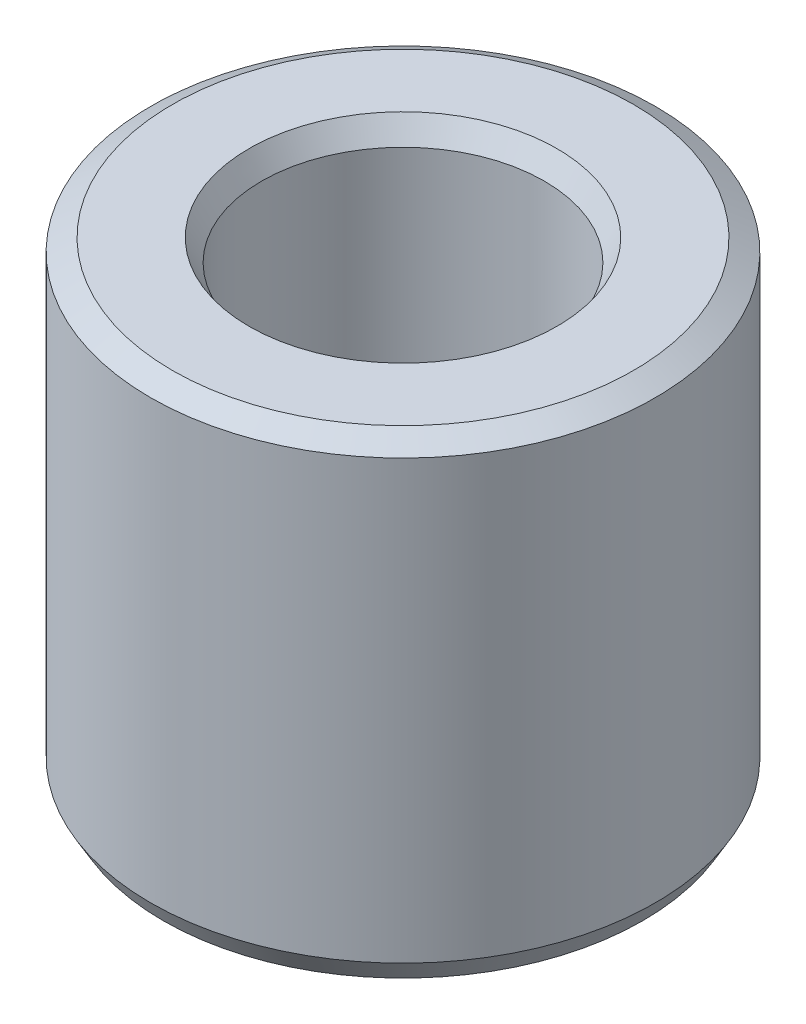
ISO-10303-21;
HEADER;
FILE_DESCRIPTION(('STEP AP214'),'2;1');
FILE_NAME('part.step','',(''),(''),'','','');
FILE_SCHEMA(('AUTOMOTIVE_DESIGN { 1 0 10303 214 1 1 1 1 }'));
ENDSEC;
DATA;
#1=APPLICATION_CONTEXT('core data for automotive mechanical design processes');
#2=APPLICATION_PROTOCOL_DEFINITION('international standard','automotive_design',2000,#1);
#3=PRODUCT_CONTEXT('',#1,'mechanical');
#4=PRODUCT('Part','Part','',(#3));
#5=PRODUCT_RELATED_PRODUCT_CATEGORY('part','',(#4));
#6=PRODUCT_DEFINITION_FORMATION('','',#4);
#7=PRODUCT_DEFINITION_CONTEXT('part definition',#1,'design');
#8=PRODUCT_DEFINITION('design','',#6,#7);
#9=PRODUCT_DEFINITION_SHAPE('','',#8);
#10=(LENGTH_UNIT() NAMED_UNIT(*) SI_UNIT(.MILLI.,.METRE.));
#11=(NAMED_UNIT(*) PLANE_ANGLE_UNIT() SI_UNIT($,.RADIAN.));
#12=(NAMED_UNIT(*) SI_UNIT($,.STERADIAN.) SOLID_ANGLE_UNIT());
#13=UNCERTAINTY_MEASURE_WITH_UNIT(LENGTH_MEASURE(1.E-05),#10,'distance_accuracy_value','');
#14=(GEOMETRIC_REPRESENTATION_CONTEXT(3) GLOBAL_UNCERTAINTY_ASSIGNED_CONTEXT((#13)) GLOBAL_UNIT_ASSIGNED_CONTEXT((#10,
#11,#12)) REPRESENTATION_CONTEXT('',''));
#15=CARTESIAN_POINT('',(0.,0.,0.));
#16=DIRECTION('',(0.,0.,1.));
#17=DIRECTION('',(1.,0.,0.));
#18=AXIS2_PLACEMENT_3D('',#15,#16,#17);
#19=CARTESIAN_POINT('',(0.,14.0250070746679,0.));
#20=DIRECTION('',(0.,-1.,0.));
#21=DIRECTION('',(0.,0.,-1.));
#22=AXIS2_PLACEMENT_3D('',#19,#20,#21);
#23=CYLINDRICAL_SURFACE('',#22,7.5);
#24=CARTESIAN_POINT('',(0.,0.649293109953526,0.));
#25=DIRECTION('',(0.,1.,0.));
#26=DIRECTION('',(0.,0.,1.));
#27=AXIS2_PLACEMENT_3D('',#24,#25,#26);
#28=CIRCLE('',#27,7.5);
#29=CARTESIAN_POINT('',(0.,0.649293109953526,7.5));
#30=VERTEX_POINT('',#29);
#31=EDGE_CURVE('E10',#30,#30,#28,.T.);
#32=ORIENTED_EDGE('',*,*,#31,.T.);
#33=EDGE_LOOP('',(#32));
#34=FACE_BOUND('',#33,.T.);
#35=CARTESIAN_POINT('',(0.,13.6501375228532,0.));
#36=DIRECTION('',(0.,1.,0.));
#37=DIRECTION('',(0.,0.,1.));
#38=AXIS2_PLACEMENT_3D('',#35,#36,#37);
#39=CIRCLE('',#38,7.5);
#40=CARTESIAN_POINT('',(0.,13.6501375228532,7.5));
#41=VERTEX_POINT('',#40);
#42=EDGE_CURVE('E50',#41,#41,#39,.F.);
#43=ORIENTED_EDGE('',*,*,#42,.T.);
#44=EDGE_LOOP('',(#43));
#45=FACE_BOUND('',#44,.T.);
#46=ADVANCED_FACE('F39',(#34,#45),#23,.T.);
#47=CARTESIAN_POINT('',(0.,14.0250070746679,0.));
#48=DIRECTION('',(0.,1.,0.));
#49=DIRECTION('',(0.,0.,1.));
#50=AXIS2_PLACEMENT_3D('',#47,#48,#49);
#51=PLANE('',#50);
#52=CARTESIAN_POINT('',(0.,14.0250070746679,0.));
#53=DIRECTION('',(0.,1.,0.));
#54=DIRECTION('',(0.,0.,1.));
#55=AXIS2_PLACEMENT_3D('',#52,#53,#54);
#56=CIRCLE('',#55,4.57639489546847);
#57=CARTESIAN_POINT('',(0.,14.0250070746679,4.57639489546847));
#58=VERTEX_POINT('',#57);
#59=EDGE_CURVE('E58',#58,#58,#56,.F.);
#60=ORIENTED_EDGE('',*,*,#59,.T.);
#61=EDGE_LOOP('',(#60));
#62=FACE_BOUND('',#61,.T.);
#63=CARTESIAN_POINT('',(0.,14.0250070746679,0.));
#64=DIRECTION('',(0.,1.,0.));
#65=DIRECTION('',(0.,0.,1.));
#66=AXIS2_PLACEMENT_3D('',#63,#64,#65);
#67=CIRCLE('',#66,6.85070689004649);
#68=CARTESIAN_POINT('',(0.,14.0250070746679,6.85070689004649));
#69=VERTEX_POINT('',#68);
#70=EDGE_CURVE('E61',#69,#69,#67,.T.);
#71=ORIENTED_EDGE('',*,*,#70,.T.);
#72=EDGE_LOOP('',(#71));
#73=FACE_BOUND('',#72,.T.);
#74=ADVANCED_FACE('F88',(#62,#73),#51,.T.);
#75=CARTESIAN_POINT('',(0.,0.,0.));
#76=DIRECTION('',(0.,1.,0.));
#77=DIRECTION('',(0.,0.,1.));
#78=AXIS2_PLACEMENT_3D('',#75,#76,#77);
#79=PLANE('',#78);
#80=CARTESIAN_POINT('',(0.,0.,0.));
#81=DIRECTION('',(0.,1.,0.));
#82=DIRECTION('',(0.,0.,1.));
#83=AXIS2_PLACEMENT_3D('',#80,#81,#82);
#84=CIRCLE('',#83,4.85081845360735);
#85=CARTESIAN_POINT('',(0.,0.,-4.85081845360735));
#86=VERTEX_POINT('',#85);
#87=EDGE_CURVE('E51',#86,#86,#84,.T.);
#88=ORIENTED_EDGE('',*,*,#87,.T.);
#89=EDGE_LOOP('',(#88));
#90=FACE_BOUND('',#89,.T.);
#91=CARTESIAN_POINT('',(0.,0.,0.));
#92=DIRECTION('',(0.,1.,0.));
#93=DIRECTION('',(0.,0.,1.));
#94=AXIS2_PLACEMENT_3D('',#91,#92,#93);
#95=CIRCLE('',#94,7.12513044818536);
#96=CARTESIAN_POINT('',(0.,0.,7.12513044818536));
#97=VERTEX_POINT('',#96);
#98=EDGE_CURVE('E54',#97,#97,#95,.F.);
#99=ORIENTED_EDGE('',*,*,#98,.T.);
#100=EDGE_LOOP('',(#99));
#101=FACE_BOUND('',#100,.T.);
#102=ADVANCED_FACE('F83',(#90,#101),#79,.F.);
#103=CARTESIAN_POINT('',(0.,14.0250070746679,0.));
#104=DIRECTION('',(0.,-1.,0.));
#105=DIRECTION('',(0.,0.,-1.));
#106=AXIS2_PLACEMENT_3D('',#103,#104,#105);
#107=CYLINDRICAL_SURFACE('',#106,4.20152534365384);
#108=CARTESIAN_POINT('',(0.,13.3757139647144,0.));
#109=DIRECTION('',(0.,1.,0.));
#110=DIRECTION('',(0.,0.,1.));
#111=AXIS2_PLACEMENT_3D('',#108,#109,#110);
#112=CIRCLE('',#111,4.20152534365384);
#113=CARTESIAN_POINT('',(0.,13.3757139647144,4.20152534365384));
#114=VERTEX_POINT('',#113);
#115=EDGE_CURVE('E67',#114,#114,#112,.T.);
#116=ORIENTED_EDGE('',*,*,#115,.T.);
#117=EDGE_LOOP('',(#116));
#118=FACE_BOUND('',#117,.T.);
#119=CARTESIAN_POINT('',(0.,0.374869551814634,0.));
#120=DIRECTION('',(0.,1.,0.));
#121=DIRECTION('',(0.,0.,1.));
#122=AXIS2_PLACEMENT_3D('',#119,#120,#121);
#123=CIRCLE('',#122,4.20152534365384);
#124=CARTESIAN_POINT('',(0.,0.374869551814634,-4.20152534365384));
#125=VERTEX_POINT('',#124);
#126=EDGE_CURVE('E69',#125,#125,#123,.F.);
#127=ORIENTED_EDGE('',*,*,#126,.T.);
#128=EDGE_LOOP('',(#127));
#129=FACE_BOUND('',#128,.T.);
#130=ADVANCED_FACE('F71',(#118,#129),#107,.F.);
#131=CARTESIAN_POINT('',(0.,13.3757139647144,0.));
#132=DIRECTION('',(0.,1.,0.));
#133=DIRECTION('',(0.,0.,1.));
#134=AXIS2_PLACEMENT_3D('',#131,#132,#133);
#135=CONICAL_SURFACE('',#134,4.20152534365384,0.523598775598304);
#136=ORIENTED_EDGE('',*,*,#59,.F.);
#137=EDGE_LOOP('',(#136));
#138=FACE_BOUND('',#137,.T.);
#139=ORIENTED_EDGE('',*,*,#115,.F.);
#140=EDGE_LOOP('',(#139));
#141=FACE_BOUND('',#140,.T.);
#142=ADVANCED_FACE('F77',(#138,#141),#135,.F.);
#143=CARTESIAN_POINT('',(0.,0.,0.));
#144=DIRECTION('',(0.,-1.,0.));
#145=DIRECTION('',(0.,0.,-1.));
#146=AXIS2_PLACEMENT_3D('',#143,#144,#145);
#147=CONICAL_SURFACE('',#146,4.85081845360735,1.04719755119659);
#148=CARTESIAN_POINT('',(0.,0.374869551814634,-4.20152534365384));
#149=CARTESIAN_POINT('',(0.,0.370964660649898,-4.20828881354919));
#150=CARTESIAN_POINT('',(0.,0.367059769485162,-4.21505228344454));
#151=CARTESIAN_POINT('',(0.,0.359249987155691,-4.22857922323524));
#152=CARTESIAN_POINT('',(0.,0.355345095990955,-4.23534269313059));
#153=CARTESIAN_POINT('',(0.,0.347535313661483,-4.24886963292128));
#154=CARTESIAN_POINT('',(0.,0.343630422496748,-4.25563310281663));
#155=CARTESIAN_POINT('',(0.,0.335820640167276,-4.26916004260733));
#156=CARTESIAN_POINT('',(0.,0.33191574900254,-4.27592351250268));
#157=CARTESIAN_POINT('',(0.,0.324105966673069,-4.28945045229338));
#158=CARTESIAN_POINT('',(0.,0.320201075508333,-4.29621392218873));
#159=CARTESIAN_POINT('',(0.,0.312391293178861,-4.30974086197943));
#160=CARTESIAN_POINT('',(0.,0.308486402014126,-4.31650433187477));
#161=CARTESIAN_POINT('',(0.,0.300676619684654,-4.33003127166547));
#162=CARTESIAN_POINT('',(0.,0.296771728519918,-4.33679474156082));
#163=CARTESIAN_POINT('',(0.,0.288961946190447,-4.35032168135152));
#164=CARTESIAN_POINT('',(0.,0.285057055025711,-4.35708515124687));
#165=CARTESIAN_POINT('',(0.,0.27724727269624,-4.37061209103757));
#166=CARTESIAN_POINT('',(0.,0.273342381531504,-4.37737556093292));
#167=CARTESIAN_POINT('',(0.,0.265532599202032,-4.39090250072362));
#168=CARTESIAN_POINT('',(0.,0.261627708037296,-4.39766597061896));
#169=CARTESIAN_POINT('',(0.,0.253817925707825,-4.41119291040966));
#170=CARTESIAN_POINT('',(0.,0.249913034543089,-4.41795638030501));
#171=CARTESIAN_POINT('',(0.,0.242103252213618,-4.43148332009571));
#172=CARTESIAN_POINT('',(0.,0.238198361048882,-4.43824678999106));
#173=CARTESIAN_POINT('',(0.,0.23038857871941,-4.45177372978176));
#174=CARTESIAN_POINT('',(0.,0.226483687554675,-4.45853719967711));
#175=CARTESIAN_POINT('',(0.,0.218673905225203,-4.4720641394678));
#176=CARTESIAN_POINT('',(0.,0.214769014060467,-4.47882760936315));
#177=CARTESIAN_POINT('',(0.,0.206959231730996,-4.49235454915385));
#178=CARTESIAN_POINT('',(0.,0.20305434056626,-4.4991180190492));
#179=CARTESIAN_POINT('',(0.,0.195244558236788,-4.5126449588399));
#180=CARTESIAN_POINT('',(0.,0.191339667072053,-4.51940842873525));
#181=CARTESIAN_POINT('',(0.,0.183529884742581,-4.53293536852595));
#182=CARTESIAN_POINT('',(0.,0.179624993577845,-4.53969883842129));
#183=CARTESIAN_POINT('',(0.,0.171815211248374,-4.55322577821199));
#184=CARTESIAN_POINT('',(0.,0.167910320083638,-4.55998924810734));
#185=CARTESIAN_POINT('',(0.,0.160100537754166,-4.57351618789804));
#186=CARTESIAN_POINT('',(0.,0.156195646589431,-4.58027965779339));
#187=CARTESIAN_POINT('',(0.,0.148385864259959,-4.59380659758409));
#188=CARTESIAN_POINT('',(0.,0.144480973095223,-4.60057006747944));
#189=CARTESIAN_POINT('',(0.,0.136671190765752,-4.61409700727013));
#190=CARTESIAN_POINT('',(0.,0.132766299601016,-4.62086047716548));
#191=CARTESIAN_POINT('',(0.,0.124956517271545,-4.63438741695618));
#192=CARTESIAN_POINT('',(0.,0.121051626106809,-4.64115088685153));
#193=CARTESIAN_POINT('',(0.,0.113241843777337,-4.65467782664223));
#194=CARTESIAN_POINT('',(0.,0.109336952612602,-4.66144129653758));
#195=CARTESIAN_POINT('',(0.,0.10152717028313,-4.67496823632828));
#196=CARTESIAN_POINT('',(0.,0.0976222791183942,-4.68173170622363));
#197=CARTESIAN_POINT('',(0.,0.0898124967889227,-4.69525864601432));
#198=CARTESIAN_POINT('',(0.,0.0859076056241869,-4.70202211590967));
#199=CARTESIAN_POINT('',(0.,0.0780978232947154,-4.71554905570037));
#200=CARTESIAN_POINT('',(0.,0.0741929321299796,-4.72231252559572));
#201=CARTESIAN_POINT('',(0.,0.0663831498005081,-4.73583946538642));
#202=CARTESIAN_POINT('',(0.,0.0624782586357723,-4.74260293528177));
#203=CARTESIAN_POINT('',(0.,0.0546684763063008,-4.75612987507247));
#204=CARTESIAN_POINT('',(0.,0.050763585141565,-4.76289334496781));
#205=CARTESIAN_POINT('',(0.,0.0429538028120934,-4.77642028475851));
#206=CARTESIAN_POINT('',(0.,0.0390489116473577,-4.78318375465386));
#207=CARTESIAN_POINT('',(0.,0.0312391293178861,-4.79671069444456));
#208=CARTESIAN_POINT('',(0.,0.0273342381531504,-4.80347416433991));
#209=CARTESIAN_POINT('',(0.,0.0195244558236788,-4.81700110413061));
#210=CARTESIAN_POINT('',(0.,0.0156195646589431,-4.82376457402596));
#211=CARTESIAN_POINT('',(0.,0.00780978232947154,-4.83729151381665));
#212=CARTESIAN_POINT('',(0.,0.00390489116473576,-4.844054983712));
#213=CARTESIAN_POINT('',(0.,0.,-4.85081845360735));
#214=B_SPLINE_CURVE_WITH_KNOTS('',3,(#148,#149,#150,#151,#152,#153,#154,#155,#156,#157,#158,
#159,#160,#161,#162,#163,#164,#165,#166,#167,#168,#169,#170,#171,#172,#173,#174,#175,#176,#177,
#178,#179,#180,#181,#182,#183,#184,#185,#186,#187,#188,#189,#190,#191,#192,#193,#194,#195,#196,
#197,#198,#199,#200,#201,#202,#203,#204,#205,#206,#207,#208,#209,#210,#211,#212,#213),
.UNSPECIFIED.,.F.,.F.,(4,2,2,2,2,2,2,2,2,2,2,2,2,2,2,2,2,2,2,2,2,2,2,2,2,2,2,2,2,2,2,2,4),(0.,
0.0234293469884145,0.0468586939768289,0.0702880409652434,0.0937173879536578,0.117146734942072,
0.140576081930487,0.164005428918901,0.187434775907316,0.21086412289573,0.234293469884145,
0.257722816872559,0.281152163860973,0.304581510849388,0.328010857837802,0.351440204826217,
0.374869551814631,0.398298898803046,0.421728245791459,0.445157592779874,0.468586939768288,
0.492016286756703,0.515445633745117,0.538874980733532,0.562304327721946,0.585733674710361,
0.609163021698775,0.63259236868719,0.656021715675604,0.679451062664019,0.702880409652433,
0.726309756640848,0.749739103629262),.UNSPECIFIED.);
#215=EDGE_CURVE('BSEAM73',#125,#86,#214,.T.);
#216=ORIENTED_EDGE('',*,*,#126,.F.);
#217=ORIENTED_EDGE('',*,*,#87,.F.);
#218=ORIENTED_EDGE('',*,*,#215,.T.);
#219=ORIENTED_EDGE('',*,*,#215,.F.);
#220=EDGE_LOOP('',(#216,#218,#217,#219));
#221=FACE_BOUND('',#220,.T.);
#222=ADVANCED_FACE('F73',(#221),#147,.F.);
#223=CARTESIAN_POINT('',(0.,0.649293109953526,0.));
#224=DIRECTION('',(0.,1.,0.));
#225=DIRECTION('',(0.,0.,1.));
#226=AXIS2_PLACEMENT_3D('',#223,#224,#225);
#227=CONICAL_SURFACE('',#226,7.5,0.523598775598301);
#228=ORIENTED_EDGE('',*,*,#98,.F.);
#229=EDGE_LOOP('',(#228));
#230=FACE_BOUND('',#229,.T.);
#231=ORIENTED_EDGE('',*,*,#31,.F.);
#232=EDGE_LOOP('',(#231));
#233=FACE_BOUND('',#232,.T.);
#234=ADVANCED_FACE('F76',(#230,#233),#227,.T.);
#235=CARTESIAN_POINT('',(0.,14.0250070746679,0.));
#236=DIRECTION('',(0.,-1.,0.));
#237=DIRECTION('',(0.,0.,-1.));
#238=AXIS2_PLACEMENT_3D('',#235,#236,#237);
#239=CONICAL_SURFACE('',#238,6.85070689004649,1.04719755119659);
#240=ORIENTED_EDGE('',*,*,#42,.F.);
#241=EDGE_LOOP('',(#240));
#242=FACE_BOUND('',#241,.T.);
#243=ORIENTED_EDGE('',*,*,#70,.F.);
#244=EDGE_LOOP('',(#243));
#245=FACE_BOUND('',#244,.T.);
#246=ADVANCED_FACE('F45',(#242,#245),#239,.T.);
#247=CLOSED_SHELL('',(#46,#74,#102,#130,#142,#222,#234,#246));
#248=MANIFOLD_SOLID_BREP('B2',#247);
#249=ADVANCED_BREP_SHAPE_REPRESENTATION('',(#18,#248),#14);
#250=SHAPE_DEFINITION_REPRESENTATION(#9,#249);
ENDSEC;
END-ISO-10303-21;
